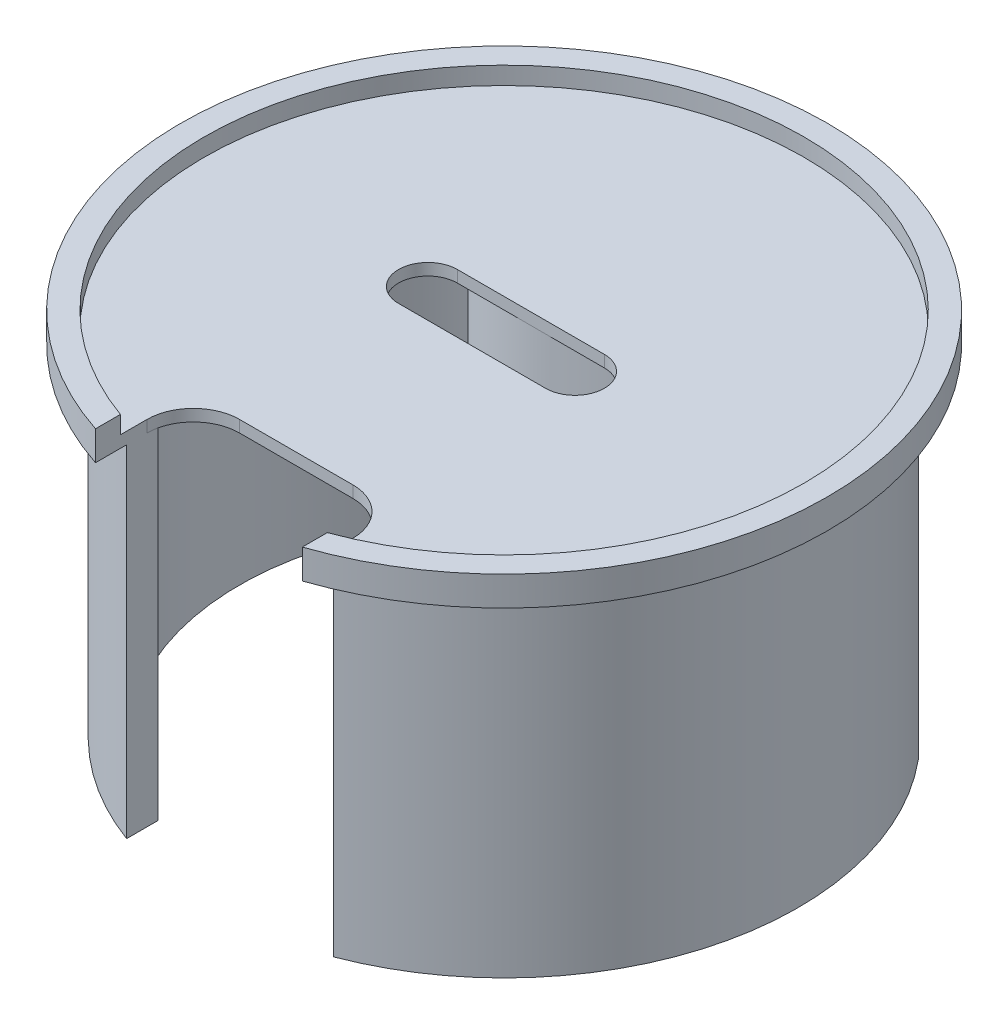
ISO-10303-21;
HEADER;
FILE_DESCRIPTION(('STEP AP214'),'2;1');
FILE_NAME('part.step','',(''),(''),'','','');
FILE_SCHEMA(('AUTOMOTIVE_DESIGN { 1 0 10303 214 1 1 1 1 }'));
ENDSEC;
DATA;
#1=APPLICATION_CONTEXT('core data for automotive mechanical design processes');
#2=APPLICATION_PROTOCOL_DEFINITION('international standard','automotive_design',2000,#1);
#3=PRODUCT_CONTEXT('',#1,'mechanical');
#4=PRODUCT('Part','Part','',(#3));
#5=PRODUCT_RELATED_PRODUCT_CATEGORY('part','',(#4));
#6=PRODUCT_DEFINITION_FORMATION('','',#4);
#7=PRODUCT_DEFINITION_CONTEXT('part definition',#1,'design');
#8=PRODUCT_DEFINITION('design','',#6,#7);
#9=PRODUCT_DEFINITION_SHAPE('','',#8);
#10=(LENGTH_UNIT() NAMED_UNIT(*) SI_UNIT(.MILLI.,.METRE.));
#11=(NAMED_UNIT(*) PLANE_ANGLE_UNIT() SI_UNIT($,.RADIAN.));
#12=(NAMED_UNIT(*) SI_UNIT($,.STERADIAN.) SOLID_ANGLE_UNIT());
#13=UNCERTAINTY_MEASURE_WITH_UNIT(LENGTH_MEASURE(1.E-05),#10,'distance_accuracy_value','');
#14=(GEOMETRIC_REPRESENTATION_CONTEXT(3) GLOBAL_UNCERTAINTY_ASSIGNED_CONTEXT((#13)) GLOBAL_UNIT_ASSIGNED_CONTEXT((#10,
#11,#12)) REPRESENTATION_CONTEXT('',''));
#15=CARTESIAN_POINT('',(0.,0.,0.));
#16=DIRECTION('',(0.,0.,1.));
#17=DIRECTION('',(1.,0.,0.));
#18=AXIS2_PLACEMENT_3D('',#15,#16,#17);
#19=CARTESIAN_POINT('',(0.,0.,0.));
#20=DIRECTION('',(0.,1.,0.));
#21=DIRECTION('',(0.,0.,1.));
#22=AXIS2_PLACEMENT_3D('',#19,#20,#21);
#23=PLANE('',#22);
#24=CARTESIAN_POINT('',(-16.4484896272888,0.,0.));
#25=DIRECTION('',(0.,1.,0.));
#26=DIRECTION('',(0.,0.,1.));
#27=AXIS2_PLACEMENT_3D('',#24,#25,#26);
#28=CIRCLE('',#27,6.35);
#29=CARTESIAN_POINT('',(-16.4484896272888,0.,-6.35));
#30=VERTEX_POINT('',#29);
#31=CARTESIAN_POINT('',(-16.4484896272888,0.,6.35));
#32=VERTEX_POINT('',#31);
#33=EDGE_CURVE('E393',#30,#32,#28,.T.);
#34=ORIENTED_EDGE('',*,*,#33,.T.);
#35=DIRECTION('',(1.,0.,0.));
#36=VECTOR('',#35,1.);
#37=CARTESIAN_POINT('',(-16.4484896272888,0.,6.35));
#38=LINE('',#37,#36);
#39=CARTESIAN_POINT('',(15.3015103727112,0.,6.35));
#40=VERTEX_POINT('',#39);
#41=EDGE_CURVE('E397',#32,#40,#38,.T.);
#42=ORIENTED_EDGE('',*,*,#41,.T.);
#43=CARTESIAN_POINT('',(15.3015103727112,0.,0.));
#44=DIRECTION('',(0.,1.,0.));
#45=DIRECTION('',(0.,0.,1.));
#46=AXIS2_PLACEMENT_3D('',#43,#44,#45);
#47=CIRCLE('',#46,6.35);
#48=CARTESIAN_POINT('',(15.3015103727112,0.,-6.35));
#49=VERTEX_POINT('',#48);
#50=EDGE_CURVE('E401',#40,#49,#47,.T.);
#51=ORIENTED_EDGE('',*,*,#50,.T.);
#52=DIRECTION('',(-1.,0.,0.));
#53=VECTOR('',#52,1.);
#54=CARTESIAN_POINT('',(-16.4484896272888,0.,-6.35));
#55=LINE('',#54,#53);
#56=EDGE_CURVE('E404',#49,#30,#55,.T.);
#57=ORIENTED_EDGE('',*,*,#56,.T.);
#58=EDGE_LOOP('',(#34,#42,#51,#57));
#59=FACE_BOUND('',#58,.T.);
#60=CARTESIAN_POINT('',(0.,0.,0.));
#61=DIRECTION('',(0.,1.,0.));
#62=DIRECTION('',(0.,0.,1.));
#63=AXIS2_PLACEMENT_3D('',#60,#61,#62);
#64=CIRCLE('',#63,57.15);
#65=CARTESIAN_POINT('',(22.5371652830511,0.,52.5185555875677));
#66=VERTEX_POINT('',#65);
#67=CARTESIAN_POINT('',(40.1810017296732,0.,-40.64));
#68=VERTEX_POINT('',#67);
#69=EDGE_CURVE('E263',#66,#68,#64,.T.);
#70=ORIENTED_EDGE('',*,*,#69,.F.);
#71=DIRECTION('',(0.,0.,1.));
#72=VECTOR('',#71,1.);
#73=CARTESIAN_POINT('',(22.5371652830511,0.,0.));
#74=LINE('',#73,#72);
#75=CARTESIAN_POINT('',(22.5371652830511,0.,55.2053311286864));
#76=VERTEX_POINT('',#75);
#77=EDGE_CURVE('E254',#66,#76,#74,.T.);
#78=ORIENTED_EDGE('',*,*,#77,.T.);
#79=CARTESIAN_POINT('',(12.5371652830511,0.,55.2053311286864));
#80=DIRECTION('',(0.,1.,0.));
#81=DIRECTION('',(0.,0.,1.));
#82=AXIS2_PLACEMENT_3D('',#79,#80,#81);
#83=CIRCLE('',#82,10.);
#84=CARTESIAN_POINT('',(12.5371652830511,0.,45.2053311286864));
#85=VERTEX_POINT('',#84);
#86=EDGE_CURVE('E457',#76,#85,#83,.T.);
#87=ORIENTED_EDGE('',*,*,#86,.T.);
#88=DIRECTION('',(-1.,0.,0.));
#89=VECTOR('',#88,1.);
#90=CARTESIAN_POINT('',(22.5371652830511,0.,45.2053311286864));
#91=LINE('',#90,#89);
#92=CARTESIAN_POINT('',(-11.9128347169489,0.,45.2053311286864));
#93=VERTEX_POINT('',#92);
#94=EDGE_CURVE('E348',#85,#93,#91,.T.);
#95=ORIENTED_EDGE('',*,*,#94,.T.);
#96=CARTESIAN_POINT('',(-11.9128347169489,0.,55.2053311286864));
#97=DIRECTION('',(0.,1.,0.));
#98=DIRECTION('',(0.,0.,1.));
#99=AXIS2_PLACEMENT_3D('',#96,#97,#98);
#100=CIRCLE('',#99,10.);
#101=CARTESIAN_POINT('',(-21.9128347169489,0.,55.2053311286864));
#102=VERTEX_POINT('',#101);
#103=EDGE_CURVE('E11',#93,#102,#100,.T.);
#104=ORIENTED_EDGE('',*,*,#103,.T.);
#105=DIRECTION('',(0.,0.,-1.));
#106=VECTOR('',#105,1.);
#107=CARTESIAN_POINT('',(-21.912834716949,0.,0.));
#108=LINE('',#107,#106);
#109=CARTESIAN_POINT('',(-21.9128347169489,0.,52.7821008928943));
#110=VERTEX_POINT('',#109);
#111=EDGE_CURVE('E280',#102,#110,#108,.T.);
#112=ORIENTED_EDGE('',*,*,#111,.T.);
#113=CARTESIAN_POINT('',(0.,0.,0.));
#114=DIRECTION('',(0.,1.,0.));
#115=DIRECTION('',(0.,0.,1.));
#116=AXIS2_PLACEMENT_3D('',#113,#114,#115);
#117=CIRCLE('',#116,57.15);
#118=CARTESIAN_POINT('',(-40.1810017296732,0.,-40.64));
#119=VERTEX_POINT('',#118);
#120=EDGE_CURVE('E296',#119,#110,#117,.T.);
#121=ORIENTED_EDGE('',*,*,#120,.F.);
#122=DIRECTION('',(-1.,0.,0.));
#123=VECTOR('',#122,1.);
#124=CARTESIAN_POINT('',(0.,0.,-40.64));
#125=LINE('',#124,#123);
#126=CARTESIAN_POINT('',(-48.7918066892383,0.,-40.64));
#127=VERTEX_POINT('',#126);
#128=EDGE_CURVE('E299',#119,#127,#125,.T.);
#129=ORIENTED_EDGE('',*,*,#128,.T.);
#130=CARTESIAN_POINT('',(0.,0.,0.));
#131=DIRECTION('',(0.,1.,0.));
#132=DIRECTION('',(0.,0.,1.));
#133=AXIS2_PLACEMENT_3D('',#130,#131,#132);
#134=CIRCLE('',#133,63.5);
#135=CARTESIAN_POINT('',(-21.9128347169489,0.,59.5993093472372));
#136=VERTEX_POINT('',#135);
#137=EDGE_CURVE('E293',#127,#136,#134,.T.);
#138=ORIENTED_EDGE('',*,*,#137,.T.);
#139=DIRECTION('',(0.,0.,1.));
#140=VECTOR('',#139,1.);
#141=CARTESIAN_POINT('',(-21.9128347169489,0.,45.2053311286864));
#142=LINE('',#141,#140);
#143=CARTESIAN_POINT('',(-21.9128347169489,0.,66.3238281062521));
#144=VERTEX_POINT('',#143);
#145=EDGE_CURVE('E353',#136,#144,#142,.T.);
#146=ORIENTED_EDGE('',*,*,#145,.T.);
#147=CARTESIAN_POINT('',(0.,0.,0.));
#148=DIRECTION('',(0.,1.,0.));
#149=DIRECTION('',(0.,0.,1.));
#150=AXIS2_PLACEMENT_3D('',#147,#148,#149);
#151=CIRCLE('',#150,69.85);
#152=CARTESIAN_POINT('',(22.5371652830511,0.,66.1142849995705));
#153=VERTEX_POINT('',#152);
#154=EDGE_CURVE('E418',#153,#144,#151,.T.);
#155=ORIENTED_EDGE('',*,*,#154,.F.);
#156=DIRECTION('',(0.,0.,-1.));
#157=VECTOR('',#156,1.);
#158=CARTESIAN_POINT('',(22.5371652830511,0.,45.2053311286864));
#159=LINE('',#158,#157);
#160=CARTESIAN_POINT('',(22.5371652830511,0.,59.3660355843679));
#161=VERTEX_POINT('',#160);
#162=EDGE_CURVE('E345',#153,#161,#159,.T.);
#163=ORIENTED_EDGE('',*,*,#162,.T.);
#164=CARTESIAN_POINT('',(0.,0.,0.));
#165=DIRECTION('',(0.,1.,0.));
#166=DIRECTION('',(0.,0.,1.));
#167=AXIS2_PLACEMENT_3D('',#164,#165,#166);
#168=CIRCLE('',#167,63.5);
#169=CARTESIAN_POINT('',(48.7918066892383,0.,-40.64));
#170=VERTEX_POINT('',#169);
#171=EDGE_CURVE('E230',#161,#170,#168,.T.);
#172=ORIENTED_EDGE('',*,*,#171,.T.);
#173=DIRECTION('',(1.,0.,0.));
#174=VECTOR('',#173,1.);
#175=CARTESIAN_POINT('',(0.,0.,-40.64));
#176=LINE('',#175,#174);
#177=EDGE_CURVE('E261',#68,#170,#176,.T.);
#178=ORIENTED_EDGE('',*,*,#177,.F.);
#179=EDGE_LOOP('',(#70,#78,#87,#95,#104,#112,#121,#129,#138,#146,#155,#163,#172,#178));
#180=FACE_BOUND('',#179,.T.);
#181=CARTESIAN_POINT('',(0.,0.,-40.64));
#182=DIRECTION('',(0.,-1.,0.));
#183=DIRECTION('',(0.,0.,-1.));
#184=AXIS2_PLACEMENT_3D('',#181,#182,#183);
#185=CIRCLE('',#184,34.2582068835355);
#186=CARTESIAN_POINT('',(34.2582068835355,0.,-40.64));
#187=VERTEX_POINT('',#186);
#188=CARTESIAN_POINT('',(-34.2582068835355,0.,-40.64));
#189=VERTEX_POINT('',#188);
#190=EDGE_CURVE('E303',#187,#189,#185,.T.);
#191=ORIENTED_EDGE('',*,*,#190,.F.);
#192=DIRECTION('',(1.,0.,0.));
#193=VECTOR('',#192,1.);
#194=CARTESIAN_POINT('',(34.2582068835355,0.,-40.64));
#195=LINE('',#194,#193);
#196=CARTESIAN_POINT('',(30.4482068835355,0.,-40.64));
#197=VERTEX_POINT('',#196);
#198=EDGE_CURVE('E309',#197,#187,#195,.T.);
#199=ORIENTED_EDGE('',*,*,#198,.F.);
#200=CARTESIAN_POINT('',(0.,0.,-40.64));
#201=DIRECTION('',(0.,1.,0.));
#202=DIRECTION('',(0.,0.,-1.));
#203=AXIS2_PLACEMENT_3D('',#200,#201,#202);
#204=CIRCLE('',#203,30.4482068835355);
#205=CARTESIAN_POINT('',(-30.4482068835355,0.,-40.64));
#206=VERTEX_POINT('',#205);
#207=EDGE_CURVE('E325',#206,#197,#204,.T.);
#208=ORIENTED_EDGE('',*,*,#207,.F.);
#209=DIRECTION('',(1.,0.,0.));
#210=VECTOR('',#209,1.);
#211=CARTESIAN_POINT('',(-30.4482068835355,0.,-40.64));
#212=LINE('',#211,#210);
#213=EDGE_CURVE('E321',#189,#206,#212,.T.);
#214=ORIENTED_EDGE('',*,*,#213,.F.);
#215=EDGE_LOOP('',(#191,#199,#208,#214));
#216=FACE_BOUND('',#215,.T.);
#217=ADVANCED_FACE('F41',(#59,#180,#216),#23,.F.);
#218=CARTESIAN_POINT('',(-16.4484896272888,6.35,0.));
#219=DIRECTION('',(0.,-1.,0.));
#220=DIRECTION('',(0.,0.,-1.));
#221=AXIS2_PLACEMENT_3D('',#218,#219,#220);
#222=CYLINDRICAL_SURFACE('',#221,6.35);
#223=DIRECTION('',(0.,-1.,0.));
#224=VECTOR('',#223,1.);
#225=CARTESIAN_POINT('',(-16.4484896272888,6.35,-6.35));
#226=LINE('',#225,#224);
#227=CARTESIAN_POINT('',(-16.4484896272888,2.54,-6.35));
#228=VERTEX_POINT('',#227);
#229=EDGE_CURVE('E408',#228,#30,#226,.T.);
#230=ORIENTED_EDGE('',*,*,#229,.F.);
#231=CARTESIAN_POINT('',(-16.4484896272888,2.54,0.));
#232=DIRECTION('',(0.,1.,0.));
#233=DIRECTION('',(0.,0.,1.));
#234=AXIS2_PLACEMENT_3D('',#231,#232,#233);
#235=CIRCLE('',#234,6.35);
#236=CARTESIAN_POINT('',(-16.4484896272888,2.54,6.35));
#237=VERTEX_POINT('',#236);
#238=EDGE_CURVE('E389',#228,#237,#235,.T.);
#239=ORIENTED_EDGE('',*,*,#238,.T.);
#240=DIRECTION('',(0.,-1.,0.));
#241=VECTOR('',#240,1.);
#242=CARTESIAN_POINT('',(-16.4484896272888,6.35,6.35));
#243=LINE('',#242,#241);
#244=EDGE_CURVE('E415',#237,#32,#243,.T.);
#245=ORIENTED_EDGE('',*,*,#244,.T.);
#246=ORIENTED_EDGE('',*,*,#33,.F.);
#247=EDGE_LOOP('',(#230,#239,#245,#246));
#248=FACE_BOUND('',#247,.T.);
#249=ADVANCED_FACE('F521',(#248),#222,.F.);
#250=CARTESIAN_POINT('',(-16.4484896272888,6.35,6.35));
#251=DIRECTION('',(0.,0.,-1.));
#252=DIRECTION('',(-1.,0.,0.));
#253=AXIS2_PLACEMENT_3D('',#250,#251,#252);
#254=PLANE('',#253);
#255=ORIENTED_EDGE('',*,*,#244,.F.);
#256=DIRECTION('',(1.,0.,0.));
#257=VECTOR('',#256,1.);
#258=CARTESIAN_POINT('',(-16.4484896272888,2.54,6.35));
#259=LINE('',#258,#257);
#260=CARTESIAN_POINT('',(15.3015103727112,2.54,6.35));
#261=VERTEX_POINT('',#260);
#262=EDGE_CURVE('E385',#237,#261,#259,.T.);
#263=ORIENTED_EDGE('',*,*,#262,.T.);
#264=DIRECTION('',(0.,-1.,0.));
#265=VECTOR('',#264,1.);
#266=CARTESIAN_POINT('',(15.3015103727112,6.35,6.35));
#267=LINE('',#266,#265);
#268=EDGE_CURVE('E413',#261,#40,#267,.T.);
#269=ORIENTED_EDGE('',*,*,#268,.T.);
#270=ORIENTED_EDGE('',*,*,#41,.F.);
#271=EDGE_LOOP('',(#255,#263,#269,#270));
#272=FACE_BOUND('',#271,.T.);
#273=ADVANCED_FACE('F527',(#272),#254,.T.);
#274=CARTESIAN_POINT('',(15.3015103727112,6.35,0.));
#275=DIRECTION('',(0.,-1.,0.));
#276=DIRECTION('',(0.,0.,-1.));
#277=AXIS2_PLACEMENT_3D('',#274,#275,#276);
#278=CYLINDRICAL_SURFACE('',#277,6.35);
#279=ORIENTED_EDGE('',*,*,#268,.F.);
#280=CARTESIAN_POINT('',(15.3015103727112,2.54,0.));
#281=DIRECTION('',(0.,1.,0.));
#282=DIRECTION('',(0.,0.,1.));
#283=AXIS2_PLACEMENT_3D('',#280,#281,#282);
#284=CIRCLE('',#283,6.35);
#285=CARTESIAN_POINT('',(15.3015103727112,2.54,-6.35));
#286=VERTEX_POINT('',#285);
#287=EDGE_CURVE('E379',#261,#286,#284,.T.);
#288=ORIENTED_EDGE('',*,*,#287,.T.);
#289=DIRECTION('',(0.,-1.,0.));
#290=VECTOR('',#289,1.);
#291=CARTESIAN_POINT('',(15.3015103727112,6.35,-6.35));
#292=LINE('',#291,#290);
#293=EDGE_CURVE('E411',#286,#49,#292,.T.);
#294=ORIENTED_EDGE('',*,*,#293,.T.);
#295=ORIENTED_EDGE('',*,*,#50,.F.);
#296=EDGE_LOOP('',(#279,#288,#294,#295));
#297=FACE_BOUND('',#296,.T.);
#298=ADVANCED_FACE('F555',(#297),#278,.F.);
#299=CARTESIAN_POINT('',(-16.4484896272888,6.35,-6.35));
#300=DIRECTION('',(0.,0.,1.));
#301=DIRECTION('',(1.,0.,0.));
#302=AXIS2_PLACEMENT_3D('',#299,#300,#301);
#303=PLANE('',#302);
#304=ORIENTED_EDGE('',*,*,#293,.F.);
#305=DIRECTION('',(-1.,0.,0.));
#306=VECTOR('',#305,1.);
#307=CARTESIAN_POINT('',(-16.4484896272888,2.54,-6.35));
#308=LINE('',#307,#306);
#309=EDGE_CURVE('E423',#286,#228,#308,.T.);
#310=ORIENTED_EDGE('',*,*,#309,.T.);
#311=ORIENTED_EDGE('',*,*,#229,.T.);
#312=ORIENTED_EDGE('',*,*,#56,.F.);
#313=EDGE_LOOP('',(#304,#310,#311,#312));
#314=FACE_BOUND('',#313,.T.);
#315=ADVANCED_FACE('F552',(#314),#303,.T.);
#316=CARTESIAN_POINT('',(0.,6.35,0.));
#317=DIRECTION('',(0.,1.,0.));
#318=DIRECTION('',(0.,0.,1.));
#319=AXIS2_PLACEMENT_3D('',#316,#317,#318);
#320=PLANE('',#319);
#321=DIRECTION('',(0.,0.,-1.));
#322=VECTOR('',#321,1.);
#323=CARTESIAN_POINT('',(22.5371652830511,6.35,45.2053311286864));
#324=LINE('',#323,#322);
#325=CARTESIAN_POINT('',(22.5371652830511,6.35,66.1142849995705));
#326=VERTEX_POINT('',#325);
#327=CARTESIAN_POINT('',(22.5371652830511,6.35,60.7225582547741));
#328=VERTEX_POINT('',#327);
#329=EDGE_CURVE('E344',#326,#328,#324,.T.);
#330=ORIENTED_EDGE('',*,*,#329,.F.);
#331=CARTESIAN_POINT('',(0.,6.35,0.));
#332=DIRECTION('',(0.,1.,0.));
#333=DIRECTION('',(0.,0.,1.));
#334=AXIS2_PLACEMENT_3D('',#331,#332,#333);
#335=CIRCLE('',#334,69.85);
#336=CARTESIAN_POINT('',(-21.9128347169489,6.35,66.3238281062521));
#337=VERTEX_POINT('',#336);
#338=EDGE_CURVE('E419',#326,#337,#335,.T.);
#339=ORIENTED_EDGE('',*,*,#338,.T.);
#340=DIRECTION('',(0.,0.,1.));
#341=VECTOR('',#340,1.);
#342=CARTESIAN_POINT('',(-21.9128347169489,6.35,45.2053311286864));
#343=LINE('',#342,#341);
#344=CARTESIAN_POINT('',(-21.9128347169489,6.35,60.9506404779119));
#345=VERTEX_POINT('',#344);
#346=EDGE_CURVE('E349',#345,#337,#343,.T.);
#347=ORIENTED_EDGE('',*,*,#346,.F.);
#348=CARTESIAN_POINT('',(0.,6.35,0.));
#349=DIRECTION('',(0.,1.,0.));
#350=DIRECTION('',(0.,0.,1.));
#351=AXIS2_PLACEMENT_3D('',#348,#349,#350);
#352=CIRCLE('',#351,64.77);
#353=EDGE_CURVE('E374',#328,#345,#352,.T.);
#354=ORIENTED_EDGE('',*,*,#353,.F.);
#355=EDGE_LOOP('',(#330,#339,#347,#354));
#356=FACE_BOUND('',#355,.T.);
#357=ADVANCED_FACE('F493',(#356),#320,.T.);
#358=CARTESIAN_POINT('',(0.,6.35,0.));
#359=DIRECTION('',(0.,-1.,0.));
#360=DIRECTION('',(0.,0.,-1.));
#361=AXIS2_PLACEMENT_3D('',#358,#359,#360);
#362=CYLINDRICAL_SURFACE('',#361,69.85);
#363=ORIENTED_EDGE('',*,*,#338,.F.);
#364=DIRECTION('',(0.,-1.,0.));
#365=VECTOR('',#364,1.);
#366=CARTESIAN_POINT('',(22.5371652830511,6.35,66.1142849995705));
#367=LINE('',#366,#365);
#368=EDGE_CURVE('E370',#326,#153,#367,.T.);
#369=ORIENTED_EDGE('',*,*,#368,.T.);
#370=ORIENTED_EDGE('',*,*,#154,.T.);
#371=DIRECTION('',(0.,-1.,0.));
#372=VECTOR('',#371,1.);
#373=CARTESIAN_POINT('',(-21.9128347169489,6.35,66.3238281062521));
#374=LINE('',#373,#372);
#375=EDGE_CURVE('E363',#144,#337,#374,.F.);
#376=ORIENTED_EDGE('',*,*,#375,.T.);
#377=EDGE_LOOP('',(#363,#369,#370,#376));
#378=FACE_BOUND('',#377,.T.);
#379=ADVANCED_FACE('F496',(#378),#362,.T.);
#380=CARTESIAN_POINT('',(0.,2.54,0.));
#381=DIRECTION('',(0.,1.,0.));
#382=DIRECTION('',(0.,0.,1.));
#383=AXIS2_PLACEMENT_3D('',#380,#381,#382);
#384=CYLINDRICAL_SURFACE('',#383,64.77);
#385=CARTESIAN_POINT('',(0.,2.54,0.));
#386=DIRECTION('',(0.,1.,0.));
#387=DIRECTION('',(0.,0.,1.));
#388=AXIS2_PLACEMENT_3D('',#385,#386,#387);
#389=CIRCLE('',#388,64.77);
#390=CARTESIAN_POINT('',(22.5371652830511,2.54,60.7225582547741));
#391=VERTEX_POINT('',#390);
#392=CARTESIAN_POINT('',(-21.9128347169489,2.54,60.9506404779119));
#393=VERTEX_POINT('',#392);
#394=EDGE_CURVE('E375',#391,#393,#389,.T.);
#395=ORIENTED_EDGE('',*,*,#394,.F.);
#396=DIRECTION('',(0.,1.,0.));
#397=VECTOR('',#396,1.);
#398=CARTESIAN_POINT('',(22.5371652830511,2.54,60.7225582547741));
#399=LINE('',#398,#397);
#400=EDGE_CURVE('E367',#391,#328,#399,.T.);
#401=ORIENTED_EDGE('',*,*,#400,.T.);
#402=ORIENTED_EDGE('',*,*,#353,.T.);
#403=DIRECTION('',(0.,1.,0.));
#404=VECTOR('',#403,1.);
#405=CARTESIAN_POINT('',(-21.9128347169489,2.54,60.9506404779119));
#406=LINE('',#405,#404);
#407=EDGE_CURVE('E356',#345,#393,#406,.F.);
#408=ORIENTED_EDGE('',*,*,#407,.T.);
#409=EDGE_LOOP('',(#395,#401,#402,#408));
#410=FACE_BOUND('',#409,.T.);
#411=ADVANCED_FACE('F484',(#410),#384,.F.);
#412=CARTESIAN_POINT('',(0.,2.54,0.));
#413=DIRECTION('',(0.,1.,0.));
#414=DIRECTION('',(0.,0.,1.));
#415=AXIS2_PLACEMENT_3D('',#412,#413,#414);
#416=PLANE('',#415);
#417=CARTESIAN_POINT('',(12.5371652830511,2.54,55.2053311286864));
#418=DIRECTION('',(0.,1.,0.));
#419=DIRECTION('',(0.,0.,1.));
#420=AXIS2_PLACEMENT_3D('',#417,#418,#419);
#421=CIRCLE('',#420,10.);
#422=CARTESIAN_POINT('',(12.5371652830511,2.54,45.2053311286864));
#423=VERTEX_POINT('',#422);
#424=CARTESIAN_POINT('',(22.5371652830511,2.54,55.2053311286864));
#425=VERTEX_POINT('',#424);
#426=EDGE_CURVE('E453',#423,#425,#421,.F.);
#427=ORIENTED_EDGE('',*,*,#426,.T.);
#428=DIRECTION('',(0.,0.,-1.));
#429=VECTOR('',#428,1.);
#430=CARTESIAN_POINT('',(22.5371652830511,2.54,0.));
#431=LINE('',#430,#429);
#432=EDGE_CURVE('E437',#391,#425,#431,.T.);
#433=ORIENTED_EDGE('',*,*,#432,.F.);
#434=ORIENTED_EDGE('',*,*,#394,.T.);
#435=DIRECTION('',(0.,0.,1.));
#436=VECTOR('',#435,1.);
#437=CARTESIAN_POINT('',(-21.912834716949,2.54,0.));
#438=LINE('',#437,#436);
#439=CARTESIAN_POINT('',(-21.9128347169489,2.54,55.2053311286864));
#440=VERTEX_POINT('',#439);
#441=EDGE_CURVE('E434',#440,#393,#438,.T.);
#442=ORIENTED_EDGE('',*,*,#441,.F.);
#443=CARTESIAN_POINT('',(-11.9128347169489,2.54,55.2053311286864));
#444=DIRECTION('',(0.,1.,0.));
#445=DIRECTION('',(0.,0.,1.));
#446=AXIS2_PLACEMENT_3D('',#443,#444,#445);
#447=CIRCLE('',#446,10.);
#448=CARTESIAN_POINT('',(-11.9128347169489,2.54,45.2053311286864));
#449=VERTEX_POINT('',#448);
#450=EDGE_CURVE('E50',#440,#449,#447,.F.);
#451=ORIENTED_EDGE('',*,*,#450,.T.);
#452=DIRECTION('',(-1.,0.,0.));
#453=VECTOR('',#452,1.);
#454=CARTESIAN_POINT('',(0.,2.54,45.2053311286864));
#455=LINE('',#454,#453);
#456=EDGE_CURVE('E430',#423,#449,#455,.T.);
#457=ORIENTED_EDGE('',*,*,#456,.F.);
#458=EDGE_LOOP('',(#427,#433,#434,#442,#451,#457));
#459=FACE_BOUND('',#458,.T.);
#460=ORIENTED_EDGE('',*,*,#309,.F.);
#461=ORIENTED_EDGE('',*,*,#287,.F.);
#462=ORIENTED_EDGE('',*,*,#262,.F.);
#463=ORIENTED_EDGE('',*,*,#238,.F.);
#464=EDGE_LOOP('',(#460,#461,#462,#463));
#465=FACE_BOUND('',#464,.T.);
#466=ADVANCED_FACE('F463',(#459,#465),#416,.T.);
#467=CARTESIAN_POINT('',(22.5371652830511,0.,45.2053311286864));
#468=DIRECTION('',(1.,0.,0.));
#469=DIRECTION('',(0.,0.,-1.));
#470=AXIS2_PLACEMENT_3D('',#467,#468,#469);
#471=PLANE('',#470);
#472=ORIENTED_EDGE('',*,*,#432,.T.);
#473=DIRECTION('',(0.,1.,0.));
#474=VECTOR('',#473,1.);
#475=CARTESIAN_POINT('',(22.5371652830511,0.,55.2053311286864));
#476=LINE('',#475,#474);
#477=EDGE_CURVE('E446',#425,#76,#476,.F.);
#478=ORIENTED_EDGE('',*,*,#477,.T.);
#479=ORIENTED_EDGE('',*,*,#77,.F.);
#480=DIRECTION('',(0.,1.,0.));
#481=VECTOR('',#480,1.);
#482=CARTESIAN_POINT('',(22.5371652830511,-73.66,52.5185555875677));
#483=LINE('',#482,#481);
#484=CARTESIAN_POINT('',(22.5371652830511,-73.66,52.5185555875677));
#485=VERTEX_POINT('',#484);
#486=EDGE_CURVE('E246',#485,#66,#483,.T.);
#487=ORIENTED_EDGE('',*,*,#486,.F.);
#488=DIRECTION('',(0.,0.,1.));
#489=VECTOR('',#488,1.);
#490=CARTESIAN_POINT('',(22.5371652830511,-73.66,0.));
#491=LINE('',#490,#489);
#492=CARTESIAN_POINT('',(22.5371652830511,-73.66,59.3660355843679));
#493=VERTEX_POINT('',#492);
#494=EDGE_CURVE('E240',#485,#493,#491,.T.);
#495=ORIENTED_EDGE('',*,*,#494,.T.);
#496=DIRECTION('',(0.,1.,0.));
#497=VECTOR('',#496,1.);
#498=CARTESIAN_POINT('',(22.5371652830511,-73.66,59.3660355843679));
#499=LINE('',#498,#497);
#500=EDGE_CURVE('E225',#493,#161,#499,.T.);
#501=ORIENTED_EDGE('',*,*,#500,.T.);
#502=ORIENTED_EDGE('',*,*,#162,.F.);
#503=ORIENTED_EDGE('',*,*,#368,.F.);
#504=ORIENTED_EDGE('',*,*,#329,.T.);
#505=ORIENTED_EDGE('',*,*,#400,.F.);
#506=EDGE_LOOP('',(#472,#478,#479,#487,#495,#501,#502,#503,#504,#505));
#507=FACE_BOUND('',#506,.T.);
#508=ADVANCED_FACE('F244',(#507),#471,.F.);
#509=CARTESIAN_POINT('',(-21.9128347169489,0.,45.2053311286864));
#510=DIRECTION('',(-1.,0.,0.));
#511=DIRECTION('',(0.,0.,1.));
#512=AXIS2_PLACEMENT_3D('',#509,#510,#511);
#513=PLANE('',#512);
#514=ORIENTED_EDGE('',*,*,#145,.F.);
#515=DIRECTION('',(0.,1.,0.));
#516=VECTOR('',#515,1.);
#517=CARTESIAN_POINT('',(-21.9128347169489,-73.66,59.5993093472372));
#518=LINE('',#517,#516);
#519=CARTESIAN_POINT('',(-21.9128347169489,-73.66,59.5993093472372));
#520=VERTEX_POINT('',#519);
#521=EDGE_CURVE('E68',#520,#136,#518,.T.);
#522=ORIENTED_EDGE('',*,*,#521,.F.);
#523=DIRECTION('',(0.,0.,-1.));
#524=VECTOR('',#523,1.);
#525=CARTESIAN_POINT('',(-21.912834716949,-73.66,0.));
#526=LINE('',#525,#524);
#527=CARTESIAN_POINT('',(-21.9128347169489,-73.66,52.7821008928943));
#528=VERTEX_POINT('',#527);
#529=EDGE_CURVE('E270',#520,#528,#526,.T.);
#530=ORIENTED_EDGE('',*,*,#529,.T.);
#531=DIRECTION('',(0.,1.,0.));
#532=VECTOR('',#531,1.);
#533=CARTESIAN_POINT('',(-21.9128347169489,-73.66,52.7821008928943));
#534=LINE('',#533,#532);
#535=EDGE_CURVE('E281',#528,#110,#534,.T.);
#536=ORIENTED_EDGE('',*,*,#535,.T.);
#537=ORIENTED_EDGE('',*,*,#111,.F.);
#538=DIRECTION('',(0.,1.,0.));
#539=VECTOR('',#538,1.);
#540=CARTESIAN_POINT('',(-21.9128347169489,2.54,55.2053311286864));
#541=LINE('',#540,#539);
#542=EDGE_CURVE('E449',#102,#440,#541,.T.);
#543=ORIENTED_EDGE('',*,*,#542,.T.);
#544=ORIENTED_EDGE('',*,*,#441,.T.);
#545=ORIENTED_EDGE('',*,*,#407,.F.);
#546=ORIENTED_EDGE('',*,*,#346,.T.);
#547=ORIENTED_EDGE('',*,*,#375,.F.);
#548=EDGE_LOOP('',(#514,#522,#530,#536,#537,#543,#544,#545,#546,#547));
#549=FACE_BOUND('',#548,.T.);
#550=ADVANCED_FACE('F489',(#549),#513,.F.);
#551=CARTESIAN_POINT('',(22.5371652830511,0.,45.2053311286864));
#552=DIRECTION('',(0.,0.,-1.));
#553=DIRECTION('',(-1.,0.,0.));
#554=AXIS2_PLACEMENT_3D('',#551,#552,#553);
#555=PLANE('',#554);
#556=ORIENTED_EDGE('',*,*,#94,.F.);
#557=DIRECTION('',(0.,1.,0.));
#558=VECTOR('',#557,1.);
#559=CARTESIAN_POINT('',(12.5371652830511,2.54,45.2053311286864));
#560=LINE('',#559,#558);
#561=EDGE_CURVE('E442',#85,#423,#560,.T.);
#562=ORIENTED_EDGE('',*,*,#561,.T.);
#563=ORIENTED_EDGE('',*,*,#456,.T.);
#564=DIRECTION('',(0.,1.,0.));
#565=VECTOR('',#564,1.);
#566=CARTESIAN_POINT('',(-11.9128347169489,0.,45.2053311286864));
#567=LINE('',#566,#565);
#568=EDGE_CURVE('E439',#449,#93,#567,.F.);
#569=ORIENTED_EDGE('',*,*,#568,.T.);
#570=EDGE_LOOP('',(#556,#562,#563,#569));
#571=FACE_BOUND('',#570,.T.);
#572=ADVANCED_FACE('F470',(#571),#555,.F.);
#573=CARTESIAN_POINT('',(12.5371652830511,0.,55.2053311286864));
#574=DIRECTION('',(0.,-1.,0.));
#575=DIRECTION('',(0.,0.,-1.));
#576=AXIS2_PLACEMENT_3D('',#573,#574,#575);
#577=CYLINDRICAL_SURFACE('',#576,10.);
#578=ORIENTED_EDGE('',*,*,#86,.F.);
#579=ORIENTED_EDGE('',*,*,#477,.F.);
#580=ORIENTED_EDGE('',*,*,#426,.F.);
#581=ORIENTED_EDGE('',*,*,#561,.F.);
#582=EDGE_LOOP('',(#578,#579,#580,#581));
#583=FACE_BOUND('',#582,.T.);
#584=ADVANCED_FACE('F479',(#583),#577,.F.);
#585=CARTESIAN_POINT('',(-11.9128347169489,0.,55.2053311286864));
#586=DIRECTION('',(0.,-1.,0.));
#587=DIRECTION('',(0.,0.,-1.));
#588=AXIS2_PLACEMENT_3D('',#585,#586,#587);
#589=CYLINDRICAL_SURFACE('',#588,10.);
#590=ORIENTED_EDGE('',*,*,#103,.F.);
#591=ORIENTED_EDGE('',*,*,#568,.F.);
#592=ORIENTED_EDGE('',*,*,#450,.F.);
#593=ORIENTED_EDGE('',*,*,#542,.F.);
#594=EDGE_LOOP('',(#590,#591,#592,#593));
#595=FACE_BOUND('',#594,.T.);
#596=ADVANCED_FACE('F43',(#595),#589,.F.);
#597=CARTESIAN_POINT('',(0.,-31.75,-40.64));
#598=DIRECTION('',(0.,1.,0.));
#599=DIRECTION('',(0.,0.,1.));
#600=AXIS2_PLACEMENT_3D('',#597,#598,#599);
#601=CYLINDRICAL_SURFACE('',#600,34.2582068835355);
#602=ORIENTED_EDGE('',*,*,#190,.T.);
#603=DIRECTION('',(0.,1.,0.));
#604=VECTOR('',#603,1.);
#605=CARTESIAN_POINT('',(-34.2582068835355,-31.75,-40.64));
#606=LINE('',#605,#604);
#607=CARTESIAN_POINT('',(-34.2582068835355,-31.75,-40.64));
#608=VERTEX_POINT('',#607);
#609=EDGE_CURVE('E340',#608,#189,#606,.T.);
#610=ORIENTED_EDGE('',*,*,#609,.F.);
#611=CARTESIAN_POINT('',(0.,-31.75,-40.64));
#612=DIRECTION('',(0.,-1.,0.));
#613=DIRECTION('',(0.,0.,-1.));
#614=AXIS2_PLACEMENT_3D('',#611,#612,#613);
#615=CIRCLE('',#614,34.2582068835355);
#616=CARTESIAN_POINT('',(34.2582068835355,-31.75,-40.64));
#617=VERTEX_POINT('',#616);
#618=EDGE_CURVE('E304',#617,#608,#615,.T.);
#619=ORIENTED_EDGE('',*,*,#618,.F.);
#620=DIRECTION('',(0.,1.,0.));
#621=VECTOR('',#620,1.);
#622=CARTESIAN_POINT('',(34.2582068835355,-31.75,-40.64));
#623=LINE('',#622,#621);
#624=EDGE_CURVE('E317',#617,#187,#623,.T.);
#625=ORIENTED_EDGE('',*,*,#624,.T.);
#626=EDGE_LOOP('',(#602,#610,#619,#625));
#627=FACE_BOUND('',#626,.T.);
#628=ADVANCED_FACE('F538',(#627),#601,.T.);
#629=CARTESIAN_POINT('',(-30.4482068835355,-31.75,-40.64));
#630=DIRECTION('',(0.,0.,1.));
#631=DIRECTION('',(1.,0.,0.));
#632=AXIS2_PLACEMENT_3D('',#629,#630,#631);
#633=PLANE('',#632);
#634=ORIENTED_EDGE('',*,*,#213,.T.);
#635=DIRECTION('',(0.,1.,0.));
#636=VECTOR('',#635,1.);
#637=CARTESIAN_POINT('',(-30.4482068835355,-31.75,-40.64));
#638=LINE('',#637,#636);
#639=CARTESIAN_POINT('',(-30.4482068835355,-31.75,-40.64));
#640=VERTEX_POINT('',#639);
#641=EDGE_CURVE('E336',#640,#206,#638,.T.);
#642=ORIENTED_EDGE('',*,*,#641,.F.);
#643=DIRECTION('',(1.,0.,0.));
#644=VECTOR('',#643,1.);
#645=CARTESIAN_POINT('',(-30.4482068835355,-31.75,-40.64));
#646=LINE('',#645,#644);
#647=EDGE_CURVE('E308',#608,#640,#646,.T.);
#648=ORIENTED_EDGE('',*,*,#647,.F.);
#649=ORIENTED_EDGE('',*,*,#609,.T.);
#650=EDGE_LOOP('',(#634,#642,#648,#649));
#651=FACE_BOUND('',#650,.T.);
#652=ADVANCED_FACE('F689',(#651),#633,.F.);
#653=CARTESIAN_POINT('',(0.,-31.75,-40.64));
#654=DIRECTION('',(0.,1.,0.));
#655=DIRECTION('',(0.,0.,1.));
#656=AXIS2_PLACEMENT_3D('',#653,#654,#655);
#657=CYLINDRICAL_SURFACE('',#656,30.4482068835355);
#658=ORIENTED_EDGE('',*,*,#207,.T.);
#659=DIRECTION('',(0.,1.,0.));
#660=VECTOR('',#659,1.);
#661=CARTESIAN_POINT('',(30.4482068835355,-31.75,-40.64));
#662=LINE('',#661,#660);
#663=CARTESIAN_POINT('',(30.4482068835355,-31.75,-40.64));
#664=VERTEX_POINT('',#663);
#665=EDGE_CURVE('E333',#664,#197,#662,.T.);
#666=ORIENTED_EDGE('',*,*,#665,.F.);
#667=CARTESIAN_POINT('',(0.,-31.75,-40.64));
#668=DIRECTION('',(0.,1.,0.));
#669=DIRECTION('',(0.,0.,-1.));
#670=AXIS2_PLACEMENT_3D('',#667,#668,#669);
#671=CIRCLE('',#670,30.4482068835355);
#672=EDGE_CURVE('E312',#640,#664,#671,.T.);
#673=ORIENTED_EDGE('',*,*,#672,.F.);
#674=ORIENTED_EDGE('',*,*,#641,.T.);
#675=EDGE_LOOP('',(#658,#666,#673,#674));
#676=FACE_BOUND('',#675,.T.);
#677=ADVANCED_FACE('F696',(#676),#657,.F.);
#678=CARTESIAN_POINT('',(34.2582068835355,-31.75,-40.64));
#679=DIRECTION('',(0.,0.,1.));
#680=DIRECTION('',(1.,0.,0.));
#681=AXIS2_PLACEMENT_3D('',#678,#679,#680);
#682=PLANE('',#681);
#683=ORIENTED_EDGE('',*,*,#198,.T.);
#684=ORIENTED_EDGE('',*,*,#624,.F.);
#685=DIRECTION('',(1.,0.,0.));
#686=VECTOR('',#685,1.);
#687=CARTESIAN_POINT('',(34.2582068835355,-31.75,-40.64));
#688=LINE('',#687,#686);
#689=EDGE_CURVE('E315',#664,#617,#688,.T.);
#690=ORIENTED_EDGE('',*,*,#689,.F.);
#691=ORIENTED_EDGE('',*,*,#665,.T.);
#692=EDGE_LOOP('',(#683,#684,#690,#691));
#693=FACE_BOUND('',#692,.T.);
#694=ADVANCED_FACE('F699',(#693),#682,.F.);
#695=CARTESIAN_POINT('',(0.,-31.75,-40.64));
#696=DIRECTION('',(0.,-1.,0.));
#697=DIRECTION('',(0.,0.,-1.));
#698=AXIS2_PLACEMENT_3D('',#695,#696,#697);
#699=PLANE('',#698);
#700=ORIENTED_EDGE('',*,*,#618,.T.);
#701=ORIENTED_EDGE('',*,*,#647,.T.);
#702=ORIENTED_EDGE('',*,*,#672,.T.);
#703=ORIENTED_EDGE('',*,*,#689,.T.);
#704=EDGE_LOOP('',(#700,#701,#702,#703));
#705=FACE_BOUND('',#704,.T.);
#706=ADVANCED_FACE('F517',(#705),#699,.T.);
#707=CARTESIAN_POINT('',(0.,-73.66,-40.64));
#708=DIRECTION('',(0.,0.,-1.));
#709=DIRECTION('',(-1.,0.,0.));
#710=AXIS2_PLACEMENT_3D('',#707,#708,#709);
#711=PLANE('',#710);
#712=ORIENTED_EDGE('',*,*,#128,.F.);
#713=DIRECTION('',(0.,1.,0.));
#714=VECTOR('',#713,1.);
#715=CARTESIAN_POINT('',(-40.1810017296732,-73.66,-40.64));
#716=LINE('',#715,#714);
#717=CARTESIAN_POINT('',(-40.1810017296732,-73.66,-40.64));
#718=VERTEX_POINT('',#717);
#719=EDGE_CURVE('E276',#718,#119,#716,.T.);
#720=ORIENTED_EDGE('',*,*,#719,.F.);
#721=DIRECTION('',(-1.,0.,0.));
#722=VECTOR('',#721,1.);
#723=CARTESIAN_POINT('',(0.,-73.66,-40.64));
#724=LINE('',#723,#722);
#725=CARTESIAN_POINT('',(-48.7918066892383,-73.66,-40.64));
#726=VERTEX_POINT('',#725);
#727=EDGE_CURVE('E265',#718,#726,#724,.T.);
#728=ORIENTED_EDGE('',*,*,#727,.T.);
#729=DIRECTION('',(0.,1.,0.));
#730=VECTOR('',#729,1.);
#731=CARTESIAN_POINT('',(-48.7918066892383,-73.66,-40.64));
#732=LINE('',#731,#730);
#733=EDGE_CURVE('E275',#726,#127,#732,.T.);
#734=ORIENTED_EDGE('',*,*,#733,.T.);
#735=EDGE_LOOP('',(#712,#720,#728,#734));
#736=FACE_BOUND('',#735,.T.);
#737=ADVANCED_FACE('F502',(#736),#711,.T.);
#738=CARTESIAN_POINT('',(0.,-73.66,0.));
#739=DIRECTION('',(0.,1.,0.));
#740=DIRECTION('',(0.,0.,1.));
#741=AXIS2_PLACEMENT_3D('',#738,#739,#740);
#742=CYLINDRICAL_SURFACE('',#741,57.15);
#743=ORIENTED_EDGE('',*,*,#719,.T.);
#744=ORIENTED_EDGE('',*,*,#120,.T.);
#745=ORIENTED_EDGE('',*,*,#535,.F.);
#746=CARTESIAN_POINT('',(0.,-73.66,0.));
#747=DIRECTION('',(0.,1.,0.));
#748=DIRECTION('',(0.,0.,1.));
#749=AXIS2_PLACEMENT_3D('',#746,#747,#748);
#750=CIRCLE('',#749,57.15);
#751=EDGE_CURVE('E273',#718,#528,#750,.T.);
#752=ORIENTED_EDGE('',*,*,#751,.F.);
#753=EDGE_LOOP('',(#743,#744,#745,#752));
#754=FACE_BOUND('',#753,.T.);
#755=ADVANCED_FACE('F509',(#754),#742,.F.);
#756=CARTESIAN_POINT('',(0.,-73.66,0.));
#757=DIRECTION('',(0.,1.,0.));
#758=DIRECTION('',(0.,0.,1.));
#759=AXIS2_PLACEMENT_3D('',#756,#757,#758);
#760=CYLINDRICAL_SURFACE('',#759,63.5);
#761=ORIENTED_EDGE('',*,*,#137,.F.);
#762=ORIENTED_EDGE('',*,*,#733,.F.);
#763=CARTESIAN_POINT('',(0.,-73.66,0.));
#764=DIRECTION('',(0.,1.,0.));
#765=DIRECTION('',(0.,0.,1.));
#766=AXIS2_PLACEMENT_3D('',#763,#764,#765);
#767=CIRCLE('',#766,63.5);
#768=EDGE_CURVE('E268',#726,#520,#767,.T.);
#769=ORIENTED_EDGE('',*,*,#768,.T.);
#770=ORIENTED_EDGE('',*,*,#521,.T.);
#771=EDGE_LOOP('',(#761,#762,#769,#770));
#772=FACE_BOUND('',#771,.T.);
#773=ADVANCED_FACE('F499',(#772),#760,.T.);
#774=CARTESIAN_POINT('',(0.,-73.66,0.));
#775=DIRECTION('',(0.,1.,0.));
#776=DIRECTION('',(0.,0.,1.));
#777=AXIS2_PLACEMENT_3D('',#774,#775,#776);
#778=PLANE('',#777);
#779=ORIENTED_EDGE('',*,*,#727,.F.);
#780=ORIENTED_EDGE('',*,*,#751,.T.);
#781=ORIENTED_EDGE('',*,*,#529,.F.);
#782=ORIENTED_EDGE('',*,*,#768,.F.);
#783=EDGE_LOOP('',(#779,#780,#781,#782));
#784=FACE_BOUND('',#783,.T.);
#785=ADVANCED_FACE('F506',(#784),#778,.F.);
#786=CARTESIAN_POINT('',(0.,-73.66,0.));
#787=DIRECTION('',(0.,1.,0.));
#788=DIRECTION('',(0.,0.,1.));
#789=AXIS2_PLACEMENT_3D('',#786,#787,#788);
#790=CYLINDRICAL_SURFACE('',#789,57.15);
#791=ORIENTED_EDGE('',*,*,#486,.T.);
#792=ORIENTED_EDGE('',*,*,#69,.T.);
#793=DIRECTION('',(0.,1.,0.));
#794=VECTOR('',#793,1.);
#795=CARTESIAN_POINT('',(40.1810017296732,-73.66,-40.64));
#796=LINE('',#795,#794);
#797=CARTESIAN_POINT('',(40.1810017296732,-73.66,-40.64));
#798=VERTEX_POINT('',#797);
#799=EDGE_CURVE('E255',#798,#68,#796,.T.);
#800=ORIENTED_EDGE('',*,*,#799,.F.);
#801=CARTESIAN_POINT('',(0.,-73.66,0.));
#802=DIRECTION('',(0.,1.,0.));
#803=DIRECTION('',(0.,0.,1.));
#804=AXIS2_PLACEMENT_3D('',#801,#802,#803);
#805=CIRCLE('',#804,57.15);
#806=EDGE_CURVE('E235',#485,#798,#805,.T.);
#807=ORIENTED_EDGE('',*,*,#806,.F.);
#808=EDGE_LOOP('',(#791,#792,#800,#807));
#809=FACE_BOUND('',#808,.T.);
#810=ADVANCED_FACE('F647',(#809),#790,.F.);
#811=CARTESIAN_POINT('',(0.,-73.66,-40.64));
#812=DIRECTION('',(0.,0.,1.));
#813=DIRECTION('',(1.,0.,0.));
#814=AXIS2_PLACEMENT_3D('',#811,#812,#813);
#815=PLANE('',#814);
#816=ORIENTED_EDGE('',*,*,#799,.T.);
#817=ORIENTED_EDGE('',*,*,#177,.T.);
#818=DIRECTION('',(0.,1.,0.));
#819=VECTOR('',#818,1.);
#820=CARTESIAN_POINT('',(48.7918066892383,-73.66,-40.64));
#821=LINE('',#820,#819);
#822=CARTESIAN_POINT('',(48.7918066892383,-73.66,-40.64));
#823=VERTEX_POINT('',#822);
#824=EDGE_CURVE('E57',#823,#170,#821,.T.);
#825=ORIENTED_EDGE('',*,*,#824,.F.);
#826=DIRECTION('',(1.,0.,0.));
#827=VECTOR('',#826,1.);
#828=CARTESIAN_POINT('',(0.,-73.66,-40.64));
#829=LINE('',#828,#827);
#830=EDGE_CURVE('E242',#798,#823,#829,.T.);
#831=ORIENTED_EDGE('',*,*,#830,.F.);
#832=EDGE_LOOP('',(#816,#817,#825,#831));
#833=FACE_BOUND('',#832,.T.);
#834=ADVANCED_FACE('F655',(#833),#815,.F.);
#835=CARTESIAN_POINT('',(0.,-73.66,0.));
#836=DIRECTION('',(0.,1.,0.));
#837=DIRECTION('',(0.,0.,1.));
#838=AXIS2_PLACEMENT_3D('',#835,#836,#837);
#839=CYLINDRICAL_SURFACE('',#838,63.5);
#840=ORIENTED_EDGE('',*,*,#171,.F.);
#841=ORIENTED_EDGE('',*,*,#500,.F.);
#842=CARTESIAN_POINT('',(0.,-73.66,0.));
#843=DIRECTION('',(0.,1.,0.));
#844=DIRECTION('',(0.,0.,1.));
#845=AXIS2_PLACEMENT_3D('',#842,#843,#844);
#846=CIRCLE('',#845,63.5);
#847=EDGE_CURVE('E228',#493,#823,#846,.T.);
#848=ORIENTED_EDGE('',*,*,#847,.T.);
#849=ORIENTED_EDGE('',*,*,#824,.T.);
#850=EDGE_LOOP('',(#840,#841,#848,#849));
#851=FACE_BOUND('',#850,.T.);
#852=ADVANCED_FACE('F227',(#851),#839,.T.);
#853=CARTESIAN_POINT('',(0.,-73.66,0.));
#854=DIRECTION('',(0.,1.,0.));
#855=DIRECTION('',(0.,0.,1.));
#856=AXIS2_PLACEMENT_3D('',#853,#854,#855);
#857=PLANE('',#856);
#858=ORIENTED_EDGE('',*,*,#494,.F.);
#859=ORIENTED_EDGE('',*,*,#806,.T.);
#860=ORIENTED_EDGE('',*,*,#830,.T.);
#861=ORIENTED_EDGE('',*,*,#847,.F.);
#862=EDGE_LOOP('',(#858,#859,#860,#861));
#863=FACE_BOUND('',#862,.T.);
#864=ADVANCED_FACE('F239',(#863),#857,.F.);
#865=CLOSED_SHELL('',(#217,#249,#273,#298,#315,#357,#379,#411,#466,#508,#550,#572,#584,#596,
#628,#652,#677,#694,#706,#737,#755,#773,#785,#810,#834,#852,#864));
#866=MANIFOLD_SOLID_BREP('B2',#865);
#867=ADVANCED_BREP_SHAPE_REPRESENTATION('',(#18,#866),#14);
#868=SHAPE_DEFINITION_REPRESENTATION(#9,#867);
ENDSEC;
END-ISO-10303-21;
